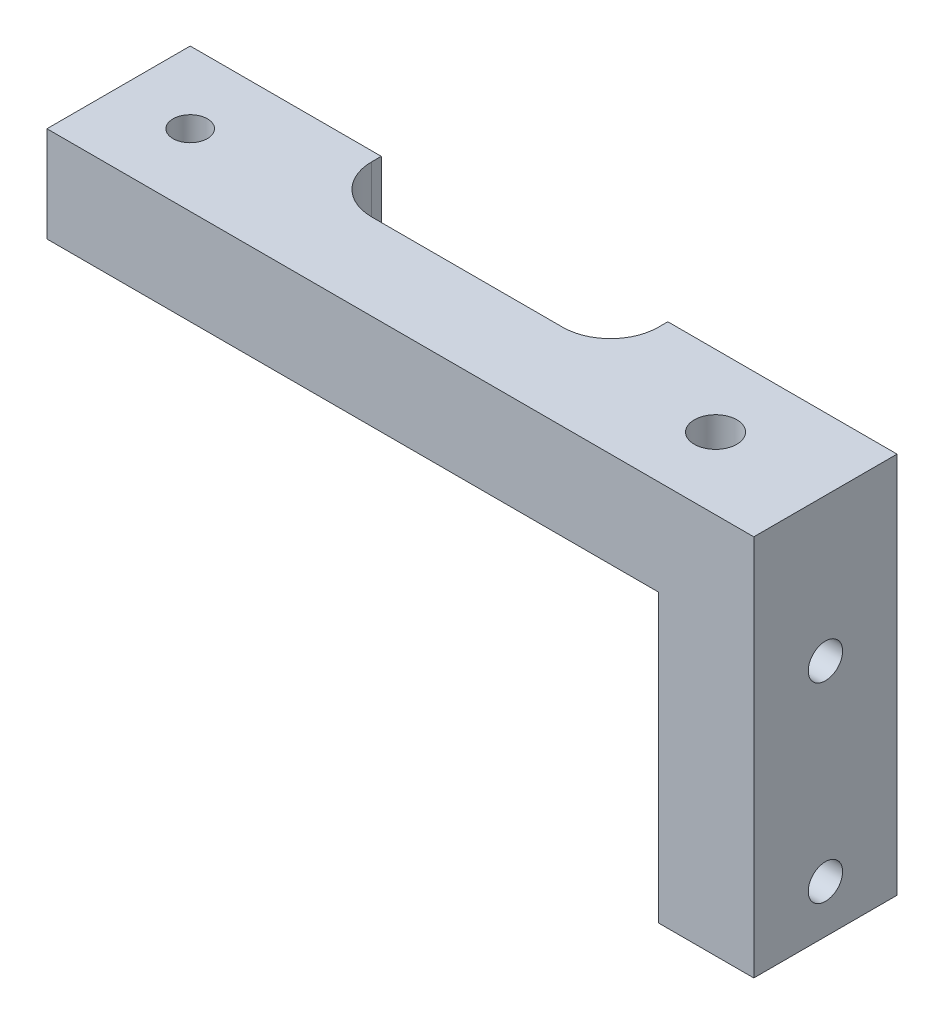
ISO-10303-21;
HEADER;
FILE_DESCRIPTION(('STEP AP214'),'2;1');
FILE_NAME('part.step','',(''),(''),'','','');
FILE_SCHEMA(('AUTOMOTIVE_DESIGN { 1 0 10303 214 1 1 1 1 }'));
ENDSEC;
DATA;
#1=APPLICATION_CONTEXT('core data for automotive mechanical design processes');
#2=APPLICATION_PROTOCOL_DEFINITION('international standard','automotive_design',2000,#1);
#3=PRODUCT_CONTEXT('',#1,'mechanical');
#4=PRODUCT('Part','Part','',(#3));
#5=PRODUCT_RELATED_PRODUCT_CATEGORY('part','',(#4));
#6=PRODUCT_DEFINITION_FORMATION('','',#4);
#7=PRODUCT_DEFINITION_CONTEXT('part definition',#1,'design');
#8=PRODUCT_DEFINITION('design','',#6,#7);
#9=PRODUCT_DEFINITION_SHAPE('','',#8);
#10=(LENGTH_UNIT() NAMED_UNIT(*) SI_UNIT(.MILLI.,.METRE.));
#11=(NAMED_UNIT(*) PLANE_ANGLE_UNIT() SI_UNIT($,.RADIAN.));
#12=(NAMED_UNIT(*) SI_UNIT($,.STERADIAN.) SOLID_ANGLE_UNIT());
#13=UNCERTAINTY_MEASURE_WITH_UNIT(LENGTH_MEASURE(1.E-05),#10,'distance_accuracy_value','');
#14=(GEOMETRIC_REPRESENTATION_CONTEXT(3) GLOBAL_UNCERTAINTY_ASSIGNED_CONTEXT((#13)) GLOBAL_UNIT_ASSIGNED_CONTEXT((#10,
#11,#12)) REPRESENTATION_CONTEXT('',''));
#15=CARTESIAN_POINT('',(0.,0.,0.));
#16=DIRECTION('',(0.,0.,1.));
#17=DIRECTION('',(1.,0.,0.));
#18=AXIS2_PLACEMENT_3D('',#15,#16,#17);
#19=CARTESIAN_POINT('',(-9.525,15.875,4.7625));
#20=DIRECTION('',(1.,0.,0.));
#21=DIRECTION('',(0.,0.,-1.));
#22=AXIS2_PLACEMENT_3D('',#19,#20,#21);
#23=CYLINDRICAL_SURFACE('',#22,1.143);
#24=CARTESIAN_POINT('',(-3.93083249249566,15.875,5.9055));
#25=CARTESIAN_POINT('',(-3.93084373483191,15.8963752694857,5.90550361654662));
#26=CARTESIAN_POINT('',(-3.93000765827515,15.9177367351948,5.90490013973631));
#27=CARTESIAN_POINT('',(-3.92674173888424,15.9602348145911,5.90251509199281));
#28=CARTESIAN_POINT('',(-3.92431468681082,15.9813717562662,5.9007355839141));
#29=CARTESIAN_POINT('',(-3.91488335347916,16.0436678967602,5.8937504752836));
#30=CARTESIAN_POINT('',(-3.90572298923987,16.0843273368617,5.88689595054274));
#31=CARTESIAN_POINT('',(-3.87889253969778,16.1779805227911,5.86600978940312));
#32=CARTESIAN_POINT('',(-3.85933306765925,16.2300234082919,5.85026723862606));
#33=CARTESIAN_POINT('',(-3.81557766279353,16.3300056623705,5.81240653443598));
#34=CARTESIAN_POINT('',(-3.79134707454787,16.3779102188144,5.79024006047459));
#35=CARTESIAN_POINT('',(-3.73138238587999,16.4868186373703,5.73064812841506));
#36=CARTESIAN_POINT('',(-3.69476579001816,16.5459168073645,5.6906228205651));
#37=CARTESIAN_POINT('',(-3.62240824039767,16.655913844966,5.60015854248359));
#38=CARTESIAN_POINT('',(-3.58666570587411,16.7068286124868,5.54974021150636));
#39=CARTESIAN_POINT('',(-3.52618200554403,16.7901230919422,5.44976619188771));
#40=CARTESIAN_POINT('',(-3.50067309992683,16.8241716281817,5.4020711847984));
#41=CARTESIAN_POINT('',(-3.45411134225465,16.8852478360566,5.30041401364303));
#42=CARTESIAN_POINT('',(-3.43305234501261,16.9122852017906,5.24646065389162));
#43=CARTESIAN_POINT('',(-3.40008133565883,16.9541899056459,5.14250124517074));
#44=CARTESIAN_POINT('',(-3.38723427299693,16.9703279197327,5.09330730809732));
#45=CARTESIAN_POINT('',(-3.36677941720066,16.9959035113964,4.99215165576483));
#46=CARTESIAN_POINT('',(-3.35916858053729,17.0053449814033,4.94019156727271));
#47=CARTESIAN_POINT('',(-3.34980307125555,17.0169517173311,4.83473590224313));
#48=CARTESIAN_POINT('',(-3.34806980195119,17.0190903901228,4.78123542771331));
#49=CARTESIAN_POINT('',(-3.35067873840373,17.0158634258158,4.67461213884869));
#50=CARTESIAN_POINT('',(-3.35502108738605,17.010497611808,4.62148933344665));
#51=CARTESIAN_POINT('',(-3.36897334404467,16.9931547553388,4.5202929747828));
#52=CARTESIAN_POINT('',(-3.37826519932184,16.9815766155992,4.47210487686006));
#53=CARTESIAN_POINT('',(-3.40123138246182,16.952709457054,4.37858780890445));
#54=CARTESIAN_POINT('',(-3.41490685830584,16.9354189422569,4.33325959154187));
#55=CARTESIAN_POINT('',(-3.4472703546422,16.8939904195196,4.24207039086234));
#56=CARTESIAN_POINT('',(-3.46630842747067,16.8693619539225,4.19655889888065));
#57=CARTESIAN_POINT('',(-3.50751346480518,16.815018144475,4.11025817617037));
#58=CARTESIAN_POINT('',(-3.52968200853343,16.7853002315415,4.06947134790405));
#59=CARTESIAN_POINT('',(-3.58083762114513,16.7148581909825,3.9848658834835));
#60=CARTESIAN_POINT('',(-3.61028656982664,16.673128970467,3.94216530995956));
#61=CARTESIAN_POINT('',(-3.67017938461612,16.5839376249998,3.86395531897599));
#62=CARTESIAN_POINT('',(-3.70062452927473,16.5364679036861,3.82845560030117));
#63=CARTESIAN_POINT('',(-3.75800503497028,16.4395870474834,3.7671396643609));
#64=CARTESIAN_POINT('',(-3.78503587312763,16.3905556229428,3.74081350093586));
#65=CARTESIAN_POINT('',(-3.83523368846054,16.2875147915302,3.69505238448322));
#66=CARTESIAN_POINT('',(-3.85840817123726,16.233515379779,3.67560396029048));
#67=CARTESIAN_POINT('',(-3.89097267874152,16.1381070721835,3.6494616442056));
#68=CARTESIAN_POINT('',(-3.9024088043216,16.0979849371407,3.64068282496282));
#69=CARTESIAN_POINT('',(-3.91990568123077,16.015958464681,3.62747395098613));
#70=CARTESIAN_POINT('',(-3.92598675905055,15.9740615047376,3.62302744491596));
#71=CARTESIAN_POINT('',(-3.93019229360773,15.9129518046768,3.61996876139128));
#72=CARTESIAN_POINT('',(-3.93085545934835,15.8939756557408,3.61949121321014));
#73=CARTESIAN_POINT('',(-3.93083249249118,15.8749999999997,3.61949999999998));
#74=B_SPLINE_CURVE_WITH_KNOTS('',3,(#24,#25,#26,#27,#28,#29,#30,#31,#32,#33,#34,#35,#36,#37,#38,
#39,#40,#41,#42,#43,#44,#45,#46,#47,#48,#49,#50,#51,#52,#53,#54,#55,#56,#57,#58,#59,#60,#61,#62,
#63,#64,#65,#66,#67,#68,#69,#70,#71,#72,#73),.UNSPECIFIED.,.F.,.F.,(4,2,2,2,2,2,2,2,2,2,2,2,2,2,
2,2,2,2,2,2,2,2,2,2,4),(0.,0.0640767086173542,0.128041318740954,0.254153859464511,
0.426558136816626,0.600294475183116,0.839796503023003,1.07882741408584,1.26984858000115,
1.46060420217215,1.61996045137766,1.77922399716499,1.93906688606315,2.0989135431291,
2.24954654389144,2.40021902465034,2.56503681214821,2.72993804395363,2.92894968206862,
3.12822761337995,3.31329780117682,3.49800346478365,3.62544615286615,3.7524029873361,
3.80932217702741),.UNSPECIFIED.);
#75=CARTESIAN_POINT('',(-3.81,16.3393117562172,5.80694415505976));
#76=VERTEX_POINT('',#75);
#77=CARTESIAN_POINT('',(-3.81,16.3393117562172,3.71805584494024));
#78=VERTEX_POINT('',#77);
#79=EDGE_CURVE('E224',#76,#78,#74,.T.);
#80=ORIENTED_EDGE('',*,*,#79,.T.);
#81=CARTESIAN_POINT('',(-3.81,15.875,4.7625));
#82=DIRECTION('',(-1.,0.,0.));
#83=DIRECTION('',(0.,0.,1.));
#84=AXIS2_PLACEMENT_3D('',#81,#82,#83);
#85=CIRCLE('',#84,1.143);
#86=EDGE_CURVE('E156',#78,#76,#85,.T.);
#87=ORIENTED_EDGE('',*,*,#86,.T.);
#88=EDGE_LOOP('',(#80,#87));
#89=FACE_BOUND('',#88,.T.);
#90=CARTESIAN_POINT('',(2.54,15.875,4.7625));
#91=DIRECTION('',(1.,0.,0.));
#92=DIRECTION('',(0.,0.,-1.));
#93=AXIS2_PLACEMENT_3D('',#90,#91,#92);
#94=CIRCLE('',#93,1.143);
#95=CARTESIAN_POINT('',(2.54,15.875,3.6195));
#96=VERTEX_POINT('',#95);
#97=EDGE_CURVE('E291',#96,#96,#94,.T.);
#98=ORIENTED_EDGE('',*,*,#97,.T.);
#99=EDGE_LOOP('',(#98));
#100=FACE_BOUND('',#99,.T.);
#101=ADVANCED_FACE('F42',(#89,#100),#23,.F.);
#102=CARTESIAN_POINT('',(0.,0.,0.));
#103=DIRECTION('',(0.,0.,1.));
#104=DIRECTION('',(1.,0.,0.));
#105=AXIS2_PLACEMENT_3D('',#102,#103,#104);
#106=PLANE('',#105);
#107=DIRECTION('',(0.,-1.,0.));
#108=VECTOR('',#107,1.);
#109=CARTESIAN_POINT('',(-3.81,0.,0.));
#110=LINE('',#109,#108);
#111=CARTESIAN_POINT('',(-3.81,19.05,0.));
#112=VERTEX_POINT('',#111);
#113=CARTESIAN_POINT('',(-3.81,0.,0.));
#114=VERTEX_POINT('',#113);
#115=EDGE_CURVE('E145',#112,#114,#110,.T.);
#116=ORIENTED_EDGE('',*,*,#115,.F.);
#117=DIRECTION('',(1.,0.,0.));
#118=VECTOR('',#117,1.);
#119=CARTESIAN_POINT('',(-44.45,19.05,0.));
#120=LINE('',#119,#118);
#121=CARTESIAN_POINT('',(-12.7,19.05,0.));
#122=VERTEX_POINT('',#121);
#123=EDGE_CURVE('E340',#122,#112,#120,.T.);
#124=ORIENTED_EDGE('',*,*,#123,.F.);
#125=DIRECTION('',(0.,1.,0.));
#126=VECTOR('',#125,1.);
#127=CARTESIAN_POINT('',(-12.7,0.,0.));
#128=LINE('',#127,#126);
#129=CARTESIAN_POINT('',(-12.7,25.4,0.));
#130=VERTEX_POINT('',#129);
#131=EDGE_CURVE('E330',#122,#130,#128,.T.);
#132=ORIENTED_EDGE('',*,*,#131,.T.);
#133=DIRECTION('',(-1.,0.,0.));
#134=VECTOR('',#133,1.);
#135=CARTESIAN_POINT('',(0.,25.4,0.));
#136=LINE('',#135,#134);
#137=CARTESIAN_POINT('',(2.54,25.4,0.));
#138=VERTEX_POINT('',#137);
#139=EDGE_CURVE('E181',#138,#130,#136,.T.);
#140=ORIENTED_EDGE('',*,*,#139,.F.);
#141=DIRECTION('',(0.,1.,0.));
#142=VECTOR('',#141,1.);
#143=CARTESIAN_POINT('',(2.54,25.4,0.));
#144=LINE('',#143,#142);
#145=CARTESIAN_POINT('',(2.54,0.,0.));
#146=VERTEX_POINT('',#145);
#147=EDGE_CURVE('E171',#146,#138,#144,.T.);
#148=ORIENTED_EDGE('',*,*,#147,.F.);
#149=DIRECTION('',(1.,0.,0.));
#150=VECTOR('',#149,1.);
#151=CARTESIAN_POINT('',(0.,0.,0.));
#152=LINE('',#151,#150);
#153=EDGE_CURVE('E162',#114,#146,#152,.T.);
#154=ORIENTED_EDGE('',*,*,#153,.F.);
#155=EDGE_LOOP('',(#116,#124,#132,#140,#148,#154));
#156=FACE_BOUND('',#155,.T.);
#157=ADVANCED_FACE('F169',(#156),#106,.F.);
#158=CARTESIAN_POINT('',(0.,25.4,9.525));
#159=DIRECTION('',(0.,-1.,0.));
#160=DIRECTION('',(1.,0.,0.));
#161=AXIS2_PLACEMENT_3D('',#158,#159,#160);
#162=PLANE('',#161);
#163=CARTESIAN_POINT('',(-39.6875,25.4,4.7625));
#164=DIRECTION('',(0.,1.,0.));
#165=DIRECTION('',(-1.,0.,0.));
#166=AXIS2_PLACEMENT_3D('',#163,#164,#165);
#167=CIRCLE('',#166,1.143);
#168=CARTESIAN_POINT('',(-40.8305,25.4,4.7625));
#169=VERTEX_POINT('',#168);
#170=EDGE_CURVE('E230',#169,#169,#167,.T.);
#171=ORIENTED_EDGE('',*,*,#170,.F.);
#172=EDGE_LOOP('',(#171));
#173=FACE_BOUND('',#172,.T.);
#174=CARTESIAN_POINT('',(-4.7625,25.4,4.7625));
#175=DIRECTION('',(0.,1.,0.));
#176=DIRECTION('',(-1.,0.,0.));
#177=AXIS2_PLACEMENT_3D('',#174,#175,#176);
#178=CIRCLE('',#177,1.41354867020506);
#179=CARTESIAN_POINT('',(-6.17604867020505,25.4,4.7625));
#180=VERTEX_POINT('',#179);
#181=EDGE_CURVE('E314',#180,#180,#178,.T.);
#182=ORIENTED_EDGE('',*,*,#181,.F.);
#183=EDGE_LOOP('',(#182));
#184=FACE_BOUND('',#183,.T.);
#185=ORIENTED_EDGE('',*,*,#139,.T.);
#186=DIRECTION('',(0.,0.,-1.));
#187=VECTOR('',#186,1.);
#188=CARTESIAN_POINT('',(-12.7,25.4,3.81000000000001));
#189=LINE('',#188,#187);
#190=CARTESIAN_POINT('',(-12.7,25.4,0.635000000000006));
#191=VERTEX_POINT('',#190);
#192=EDGE_CURVE('E229',#191,#130,#189,.T.);
#193=ORIENTED_EDGE('',*,*,#192,.F.);
#194=CARTESIAN_POINT('',(-15.875,25.4,0.635000000000005));
#195=DIRECTION('',(0.,-1.,0.));
#196=DIRECTION('',(1.,0.,0.));
#197=AXIS2_PLACEMENT_3D('',#194,#195,#196);
#198=CIRCLE('',#197,3.175);
#199=CARTESIAN_POINT('',(-15.875,25.4,3.81000000000001));
#200=VERTEX_POINT('',#199);
#201=EDGE_CURVE('E212',#191,#200,#198,.T.);
#202=ORIENTED_EDGE('',*,*,#201,.T.);
#203=DIRECTION('',(1.,0.,0.));
#204=VECTOR('',#203,1.);
#205=CARTESIAN_POINT('',(-31.75,25.4,3.81000000000001));
#206=LINE('',#205,#204);
#207=CARTESIAN_POINT('',(-28.575,25.4,3.81000000000001));
#208=VERTEX_POINT('',#207);
#209=EDGE_CURVE('E326',#208,#200,#206,.T.);
#210=ORIENTED_EDGE('',*,*,#209,.F.);
#211=CARTESIAN_POINT('',(-28.575,25.4,0.635000000000005));
#212=DIRECTION('',(0.,-1.,0.));
#213=DIRECTION('',(1.,0.,0.));
#214=AXIS2_PLACEMENT_3D('',#211,#212,#213);
#215=CIRCLE('',#214,3.175);
#216=CARTESIAN_POINT('',(-31.75,25.4,0.635000000000006));
#217=VERTEX_POINT('',#216);
#218=EDGE_CURVE('E218',#208,#217,#215,.T.);
#219=ORIENTED_EDGE('',*,*,#218,.T.);
#220=DIRECTION('',(0.,0.,1.));
#221=VECTOR('',#220,1.);
#222=CARTESIAN_POINT('',(-31.75,25.4,3.81000000000001));
#223=LINE('',#222,#221);
#224=CARTESIAN_POINT('',(-31.75,25.4,0.));
#225=VERTEX_POINT('',#224);
#226=EDGE_CURVE('E323',#225,#217,#223,.T.);
#227=ORIENTED_EDGE('',*,*,#226,.F.);
#228=CARTESIAN_POINT('',(-44.45,25.4,0.));
#229=VERTEX_POINT('',#228);
#230=EDGE_CURVE('E347',#225,#229,#136,.T.);
#231=ORIENTED_EDGE('',*,*,#230,.T.);
#232=DIRECTION('',(0.,0.,-1.));
#233=VECTOR('',#232,1.);
#234=CARTESIAN_POINT('',(-44.45,25.4,9.525));
#235=LINE('',#234,#233);
#236=CARTESIAN_POINT('',(-44.45,25.4,9.525));
#237=VERTEX_POINT('',#236);
#238=EDGE_CURVE('E185',#237,#229,#235,.T.);
#239=ORIENTED_EDGE('',*,*,#238,.F.);
#240=DIRECTION('',(-1.,0.,0.));
#241=VECTOR('',#240,1.);
#242=CARTESIAN_POINT('',(0.,25.4,9.525));
#243=LINE('',#242,#241);
#244=CARTESIAN_POINT('',(2.54,25.4,9.525));
#245=VERTEX_POINT('',#244);
#246=EDGE_CURVE('E173',#245,#237,#243,.T.);
#247=ORIENTED_EDGE('',*,*,#246,.F.);
#248=DIRECTION('',(0.,0.,1.));
#249=VECTOR('',#248,1.);
#250=CARTESIAN_POINT('',(2.54,25.4,9.525));
#251=LINE('',#250,#249);
#252=EDGE_CURVE('E310',#138,#245,#251,.T.);
#253=ORIENTED_EDGE('',*,*,#252,.F.);
#254=EDGE_LOOP('',(#185,#193,#202,#210,#219,#227,#231,#239,#247,#253));
#255=FACE_BOUND('',#254,.T.);
#256=ADVANCED_FACE('F285',(#173,#184,#255),#162,.F.);
#257=CARTESIAN_POINT('',(-44.45,0.,9.525));
#258=DIRECTION('',(1.,0.,0.));
#259=DIRECTION('',(0.,0.,-1.));
#260=AXIS2_PLACEMENT_3D('',#257,#258,#259);
#261=PLANE('',#260);
#262=DIRECTION('',(0.,-1.,0.));
#263=VECTOR('',#262,1.);
#264=CARTESIAN_POINT('',(-44.45,0.,0.));
#265=LINE('',#264,#263);
#266=CARTESIAN_POINT('',(-44.45,19.05,0.));
#267=VERTEX_POINT('',#266);
#268=EDGE_CURVE('E174',#229,#267,#265,.T.);
#269=ORIENTED_EDGE('',*,*,#268,.T.);
#270=DIRECTION('',(0.,0.,-1.));
#271=VECTOR('',#270,1.);
#272=CARTESIAN_POINT('',(-44.45,19.05,0.));
#273=LINE('',#272,#271);
#274=CARTESIAN_POINT('',(-44.45,19.05,9.525));
#275=VERTEX_POINT('',#274);
#276=EDGE_CURVE('E334',#275,#267,#273,.T.);
#277=ORIENTED_EDGE('',*,*,#276,.F.);
#278=DIRECTION('',(0.,-1.,0.));
#279=VECTOR('',#278,1.);
#280=CARTESIAN_POINT('',(-44.45,0.,9.525));
#281=LINE('',#280,#279);
#282=EDGE_CURVE('E178',#237,#275,#281,.T.);
#283=ORIENTED_EDGE('',*,*,#282,.F.);
#284=ORIENTED_EDGE('',*,*,#238,.T.);
#285=EDGE_LOOP('',(#269,#277,#283,#284));
#286=FACE_BOUND('',#285,.T.);
#287=ADVANCED_FACE('F366',(#286),#261,.F.);
#288=CARTESIAN_POINT('',(0.,0.,9.525));
#289=DIRECTION('',(0.,1.,0.));
#290=DIRECTION('',(-1.,0.,0.));
#291=AXIS2_PLACEMENT_3D('',#288,#289,#290);
#292=PLANE('',#291);
#293=DIRECTION('',(1.,0.,0.));
#294=VECTOR('',#293,1.);
#295=CARTESIAN_POINT('',(0.,0.,9.525));
#296=LINE('',#295,#294);
#297=CARTESIAN_POINT('',(-3.81,0.,9.525));
#298=VERTEX_POINT('',#297);
#299=CARTESIAN_POINT('',(2.54,0.,9.525));
#300=VERTEX_POINT('',#299);
#301=EDGE_CURVE('E164',#298,#300,#296,.T.);
#302=ORIENTED_EDGE('',*,*,#301,.F.);
#303=DIRECTION('',(0.,0.,1.));
#304=VECTOR('',#303,1.);
#305=CARTESIAN_POINT('',(-3.81,0.,0.));
#306=LINE('',#305,#304);
#307=EDGE_CURVE('E148',#114,#298,#306,.T.);
#308=ORIENTED_EDGE('',*,*,#307,.F.);
#309=ORIENTED_EDGE('',*,*,#153,.T.);
#310=DIRECTION('',(0.,0.,-1.));
#311=VECTOR('',#310,1.);
#312=CARTESIAN_POINT('',(2.54,0.,9.525));
#313=LINE('',#312,#311);
#314=EDGE_CURVE('E300',#300,#146,#313,.T.);
#315=ORIENTED_EDGE('',*,*,#314,.F.);
#316=EDGE_LOOP('',(#302,#308,#309,#315));
#317=FACE_BOUND('',#316,.T.);
#318=ADVANCED_FACE('F160',(#317),#292,.F.);
#319=CARTESIAN_POINT('',(0.,0.,9.525));
#320=DIRECTION('',(0.,0.,1.));
#321=DIRECTION('',(1.,0.,0.));
#322=AXIS2_PLACEMENT_3D('',#319,#320,#321);
#323=PLANE('',#322);
#324=DIRECTION('',(-1.,0.,0.));
#325=VECTOR('',#324,1.);
#326=CARTESIAN_POINT('',(-44.45,19.05,9.525));
#327=LINE('',#326,#325);
#328=CARTESIAN_POINT('',(-3.81,19.05,9.525));
#329=VERTEX_POINT('',#328);
#330=EDGE_CURVE('E345',#329,#275,#327,.T.);
#331=ORIENTED_EDGE('',*,*,#330,.F.);
#332=DIRECTION('',(0.,1.,0.));
#333=VECTOR('',#332,1.);
#334=CARTESIAN_POINT('',(-3.81,0.,9.525));
#335=LINE('',#334,#333);
#336=EDGE_CURVE('E166',#298,#329,#335,.T.);
#337=ORIENTED_EDGE('',*,*,#336,.F.);
#338=ORIENTED_EDGE('',*,*,#301,.T.);
#339=DIRECTION('',(0.,-1.,0.));
#340=VECTOR('',#339,1.);
#341=CARTESIAN_POINT('',(2.54,25.4,9.525));
#342=LINE('',#341,#340);
#343=EDGE_CURVE('E294',#245,#300,#342,.T.);
#344=ORIENTED_EDGE('',*,*,#343,.F.);
#345=ORIENTED_EDGE('',*,*,#246,.T.);
#346=ORIENTED_EDGE('',*,*,#282,.T.);
#347=EDGE_LOOP('',(#331,#337,#338,#344,#345,#346));
#348=FACE_BOUND('',#347,.T.);
#349=ADVANCED_FACE('F275',(#348),#323,.T.);
#350=ORIENTED_EDGE('',*,*,#230,.F.);
#351=DIRECTION('',(0.,1.,0.));
#352=VECTOR('',#351,1.);
#353=CARTESIAN_POINT('',(-31.75,0.,0.));
#354=LINE('',#353,#352);
#355=CARTESIAN_POINT('',(-31.75,19.05,0.));
#356=VERTEX_POINT('',#355);
#357=EDGE_CURVE('E331',#356,#225,#354,.T.);
#358=ORIENTED_EDGE('',*,*,#357,.F.);
#359=EDGE_CURVE('E341',#267,#356,#120,.T.);
#360=ORIENTED_EDGE('',*,*,#359,.F.);
#361=ORIENTED_EDGE('',*,*,#268,.F.);
#362=EDGE_LOOP('',(#350,#358,#360,#361));
#363=FACE_BOUND('',#362,.T.);
#364=ADVANCED_FACE('F270',(#363),#106,.F.);
#365=CARTESIAN_POINT('',(-9.525,3.175,4.7625));
#366=DIRECTION('',(1.,0.,0.));
#367=DIRECTION('',(0.,0.,-1.));
#368=AXIS2_PLACEMENT_3D('',#365,#366,#367);
#369=CYLINDRICAL_SURFACE('',#368,1.143);
#370=CARTESIAN_POINT('',(-3.81,3.175,4.7625));
#371=DIRECTION('',(-1.,0.,0.));
#372=DIRECTION('',(0.,0.,1.));
#373=AXIS2_PLACEMENT_3D('',#370,#371,#372);
#374=CIRCLE('',#373,1.143);
#375=CARTESIAN_POINT('',(-3.81,3.175,5.9055));
#376=VERTEX_POINT('',#375);
#377=EDGE_CURVE('E385',#376,#376,#374,.T.);
#378=ORIENTED_EDGE('',*,*,#377,.T.);
#379=EDGE_LOOP('',(#378));
#380=FACE_BOUND('',#379,.T.);
#381=CARTESIAN_POINT('',(2.54,3.175,4.7625));
#382=DIRECTION('',(1.,0.,0.));
#383=DIRECTION('',(0.,0.,-1.));
#384=AXIS2_PLACEMENT_3D('',#381,#382,#383);
#385=CIRCLE('',#384,1.143);
#386=CARTESIAN_POINT('',(2.54,3.175,3.6195));
#387=VERTEX_POINT('',#386);
#388=EDGE_CURVE('E295',#387,#387,#385,.T.);
#389=ORIENTED_EDGE('',*,*,#388,.T.);
#390=EDGE_LOOP('',(#389));
#391=FACE_BOUND('',#390,.T.);
#392=ADVANCED_FACE('F267',(#380,#391),#369,.F.);
#393=CARTESIAN_POINT('',(0.,19.05,0.));
#394=DIRECTION('',(0.,1.,0.));
#395=DIRECTION('',(0.,0.,1.));
#396=AXIS2_PLACEMENT_3D('',#393,#394,#395);
#397=PLANE('',#396);
#398=CARTESIAN_POINT('',(-39.6875,19.05,4.7625));
#399=DIRECTION('',(0.,1.,0.));
#400=DIRECTION('',(0.,0.,1.));
#401=AXIS2_PLACEMENT_3D('',#398,#399,#400);
#402=CIRCLE('',#401,1.143);
#403=CARTESIAN_POINT('',(-39.6875,19.05,5.9055));
#404=VERTEX_POINT('',#403);
#405=EDGE_CURVE('E225',#404,#404,#402,.T.);
#406=ORIENTED_EDGE('',*,*,#405,.T.);
#407=EDGE_LOOP('',(#406));
#408=FACE_BOUND('',#407,.T.);
#409=DIRECTION('',(0.,0.,1.));
#410=VECTOR('',#409,1.);
#411=CARTESIAN_POINT('',(-31.75,19.05,0.));
#412=LINE('',#411,#410);
#413=CARTESIAN_POINT('',(-31.75,19.05,0.635000000000005));
#414=VERTEX_POINT('',#413);
#415=EDGE_CURVE('E189',#356,#414,#412,.T.);
#416=ORIENTED_EDGE('',*,*,#415,.T.);
#417=CARTESIAN_POINT('',(-28.575,19.05,0.635000000000005));
#418=DIRECTION('',(0.,1.,0.));
#419=DIRECTION('',(0.,0.,1.));
#420=AXIS2_PLACEMENT_3D('',#417,#418,#419);
#421=CIRCLE('',#420,3.175);
#422=CARTESIAN_POINT('',(-28.575,19.05,3.81000000000001));
#423=VERTEX_POINT('',#422);
#424=EDGE_CURVE('E221',#414,#423,#421,.T.);
#425=ORIENTED_EDGE('',*,*,#424,.T.);
#426=DIRECTION('',(1.,0.,0.));
#427=VECTOR('',#426,1.);
#428=CARTESIAN_POINT('',(0.,19.05,3.81000000000001));
#429=LINE('',#428,#427);
#430=CARTESIAN_POINT('',(-15.875,19.05,3.81000000000001));
#431=VERTEX_POINT('',#430);
#432=EDGE_CURVE('E192',#423,#431,#429,.T.);
#433=ORIENTED_EDGE('',*,*,#432,.T.);
#434=CARTESIAN_POINT('',(-15.875,19.05,0.635000000000005));
#435=DIRECTION('',(0.,1.,0.));
#436=DIRECTION('',(0.,0.,1.));
#437=AXIS2_PLACEMENT_3D('',#434,#435,#436);
#438=CIRCLE('',#437,3.175);
#439=CARTESIAN_POINT('',(-12.7,19.05,0.635000000000005));
#440=VERTEX_POINT('',#439);
#441=EDGE_CURVE('E215',#431,#440,#438,.T.);
#442=ORIENTED_EDGE('',*,*,#441,.T.);
#443=DIRECTION('',(0.,0.,-1.));
#444=VECTOR('',#443,1.);
#445=CARTESIAN_POINT('',(-12.7,19.05,0.));
#446=LINE('',#445,#444);
#447=EDGE_CURVE('E196',#440,#122,#446,.T.);
#448=ORIENTED_EDGE('',*,*,#447,.T.);
#449=ORIENTED_EDGE('',*,*,#123,.T.);
#450=DIRECTION('',(0.,0.,-1.));
#451=VECTOR('',#450,1.);
#452=CARTESIAN_POINT('',(-3.81,19.05,0.));
#453=LINE('',#452,#451);
#454=CARTESIAN_POINT('',(-3.81,19.05,3.71805584494024));
#455=VERTEX_POINT('',#454);
#456=EDGE_CURVE('E151',#455,#112,#453,.T.);
#457=ORIENTED_EDGE('',*,*,#456,.F.);
#458=CARTESIAN_POINT('',(-4.7625,19.05,4.7625));
#459=DIRECTION('',(0.,1.,0.));
#460=DIRECTION('',(0.,0.,1.));
#461=AXIS2_PLACEMENT_3D('',#458,#459,#460);
#462=CIRCLE('',#461,1.41354867020506);
#463=CARTESIAN_POINT('',(-3.81,19.05,5.80694415505976));
#464=VERTEX_POINT('',#463);
#465=EDGE_CURVE('E51',#464,#455,#462,.F.);
#466=ORIENTED_EDGE('',*,*,#465,.F.);
#467=EDGE_CURVE('E58',#329,#464,#453,.T.);
#468=ORIENTED_EDGE('',*,*,#467,.F.);
#469=ORIENTED_EDGE('',*,*,#330,.T.);
#470=ORIENTED_EDGE('',*,*,#276,.T.);
#471=ORIENTED_EDGE('',*,*,#359,.T.);
#472=EDGE_LOOP('',(#416,#425,#433,#442,#448,#449,#457,#466,#468,#469,#470,#471));
#473=FACE_BOUND('',#472,.T.);
#474=ADVANCED_FACE('F264',(#408,#473),#397,.F.);
#475=CARTESIAN_POINT('',(-12.7,0.,3.81000000000001));
#476=DIRECTION('',(1.,0.,0.));
#477=DIRECTION('',(0.,1.,0.));
#478=AXIS2_PLACEMENT_3D('',#475,#476,#477);
#479=PLANE('',#478);
#480=ORIENTED_EDGE('',*,*,#447,.F.);
#481=DIRECTION('',(0.,1.,0.));
#482=VECTOR('',#481,1.);
#483=CARTESIAN_POINT('',(-12.7,25.4,0.635000000000005));
#484=LINE('',#483,#482);
#485=EDGE_CURVE('E199',#440,#191,#484,.T.);
#486=ORIENTED_EDGE('',*,*,#485,.T.);
#487=ORIENTED_EDGE('',*,*,#192,.T.);
#488=ORIENTED_EDGE('',*,*,#131,.F.);
#489=EDGE_LOOP('',(#480,#486,#487,#488));
#490=FACE_BOUND('',#489,.T.);
#491=ADVANCED_FACE('F257',(#490),#479,.F.);
#492=CARTESIAN_POINT('',(-31.75,0.,3.81000000000001));
#493=DIRECTION('',(0.,0.,1.));
#494=DIRECTION('',(1.,0.,0.));
#495=AXIS2_PLACEMENT_3D('',#492,#493,#494);
#496=PLANE('',#495);
#497=ORIENTED_EDGE('',*,*,#209,.T.);
#498=DIRECTION('',(0.,1.,0.));
#499=VECTOR('',#498,1.);
#500=CARTESIAN_POINT('',(-15.875,19.05,3.81000000000001));
#501=LINE('',#500,#499);
#502=EDGE_CURVE('E207',#200,#431,#501,.F.);
#503=ORIENTED_EDGE('',*,*,#502,.T.);
#504=ORIENTED_EDGE('',*,*,#432,.F.);
#505=DIRECTION('',(0.,1.,0.));
#506=VECTOR('',#505,1.);
#507=CARTESIAN_POINT('',(-28.575,25.4,3.81000000000001));
#508=LINE('',#507,#506);
#509=EDGE_CURVE('E203',#423,#208,#508,.T.);
#510=ORIENTED_EDGE('',*,*,#509,.T.);
#511=EDGE_LOOP('',(#497,#503,#504,#510));
#512=FACE_BOUND('',#511,.T.);
#513=ADVANCED_FACE('F253',(#512),#496,.F.);
#514=CARTESIAN_POINT('',(-31.75,0.,3.81000000000001));
#515=DIRECTION('',(-1.,0.,0.));
#516=DIRECTION('',(0.,-1.,0.));
#517=AXIS2_PLACEMENT_3D('',#514,#515,#516);
#518=PLANE('',#517);
#519=ORIENTED_EDGE('',*,*,#226,.T.);
#520=DIRECTION('',(0.,1.,0.));
#521=VECTOR('',#520,1.);
#522=CARTESIAN_POINT('',(-31.75,19.05,0.635000000000005));
#523=LINE('',#522,#521);
#524=EDGE_CURVE('E66',#217,#414,#523,.F.);
#525=ORIENTED_EDGE('',*,*,#524,.T.);
#526=ORIENTED_EDGE('',*,*,#415,.F.);
#527=ORIENTED_EDGE('',*,*,#357,.T.);
#528=EDGE_LOOP('',(#519,#525,#526,#527));
#529=FACE_BOUND('',#528,.T.);
#530=ADVANCED_FACE('F256',(#529),#518,.F.);
#531=CARTESIAN_POINT('',(-15.875,0.,0.635000000000005));
#532=DIRECTION('',(0.,-1.,0.));
#533=DIRECTION('',(1.,0.,0.));
#534=AXIS2_PLACEMENT_3D('',#531,#532,#533);
#535=CYLINDRICAL_SURFACE('',#534,3.175);
#536=ORIENTED_EDGE('',*,*,#441,.F.);
#537=ORIENTED_EDGE('',*,*,#502,.F.);
#538=ORIENTED_EDGE('',*,*,#201,.F.);
#539=ORIENTED_EDGE('',*,*,#485,.F.);
#540=EDGE_LOOP('',(#536,#537,#538,#539));
#541=FACE_BOUND('',#540,.T.);
#542=ADVANCED_FACE('F261',(#541),#535,.F.);
#543=CARTESIAN_POINT('',(-28.575,0.,0.635000000000005));
#544=DIRECTION('',(0.,-1.,0.));
#545=DIRECTION('',(1.,0.,0.));
#546=AXIS2_PLACEMENT_3D('',#543,#544,#545);
#547=CYLINDRICAL_SURFACE('',#546,3.175);
#548=ORIENTED_EDGE('',*,*,#424,.F.);
#549=ORIENTED_EDGE('',*,*,#524,.F.);
#550=ORIENTED_EDGE('',*,*,#218,.F.);
#551=ORIENTED_EDGE('',*,*,#509,.F.);
#552=EDGE_LOOP('',(#548,#549,#550,#551));
#553=FACE_BOUND('',#552,.T.);
#554=ADVANCED_FACE('F44',(#553),#547,.F.);
#555=CARTESIAN_POINT('',(-39.6875,15.875,4.7625));
#556=DIRECTION('',(0.,1.,0.));
#557=DIRECTION('',(-1.,0.,0.));
#558=AXIS2_PLACEMENT_3D('',#555,#556,#557);
#559=CYLINDRICAL_SURFACE('',#558,1.143);
#560=ORIENTED_EDGE('',*,*,#170,.T.);
#561=EDGE_LOOP('',(#560));
#562=FACE_BOUND('',#561,.T.);
#563=ORIENTED_EDGE('',*,*,#405,.F.);
#564=EDGE_LOOP('',(#563));
#565=FACE_BOUND('',#564,.T.);
#566=ADVANCED_FACE('F250',(#562,#565),#559,.F.);
#567=CARTESIAN_POINT('',(-4.76249999999999,15.875,4.7625));
#568=DIRECTION('',(0.,1.,0.));
#569=DIRECTION('',(-1.,0.,0.));
#570=AXIS2_PLACEMENT_3D('',#567,#568,#569);
#571=CYLINDRICAL_SURFACE('',#570,1.41354867020506);
#572=ORIENTED_EDGE('',*,*,#181,.T.);
#573=EDGE_LOOP('',(#572));
#574=FACE_BOUND('',#573,.T.);
#575=ORIENTED_EDGE('',*,*,#465,.T.);
#576=DIRECTION('',(0.,1.,0.));
#577=VECTOR('',#576,1.);
#578=CARTESIAN_POINT('',(-3.81,15.875,3.71805584494024));
#579=LINE('',#578,#577);
#580=EDGE_CURVE('E11',#455,#78,#579,.F.);
#581=ORIENTED_EDGE('',*,*,#580,.T.);
#582=ORIENTED_EDGE('',*,*,#79,.F.);
#583=DIRECTION('',(0.,1.,0.));
#584=VECTOR('',#583,1.);
#585=CARTESIAN_POINT('',(-3.81,15.875,5.80694415505976));
#586=LINE('',#585,#584);
#587=EDGE_CURVE('E240',#76,#464,#586,.T.);
#588=ORIENTED_EDGE('',*,*,#587,.T.);
#589=EDGE_LOOP('',(#575,#581,#582,#588));
#590=FACE_BOUND('',#589,.T.);
#591=ADVANCED_FACE('F244',(#574,#590),#571,.F.);
#592=CARTESIAN_POINT('',(2.54,0.,0.));
#593=DIRECTION('',(1.,0.,0.));
#594=DIRECTION('',(0.,0.,-1.));
#595=AXIS2_PLACEMENT_3D('',#592,#593,#594);
#596=PLANE('',#595);
#597=ORIENTED_EDGE('',*,*,#97,.F.);
#598=EDGE_LOOP('',(#597));
#599=FACE_BOUND('',#598,.T.);
#600=ORIENTED_EDGE('',*,*,#343,.T.);
#601=ORIENTED_EDGE('',*,*,#314,.T.);
#602=ORIENTED_EDGE('',*,*,#147,.T.);
#603=ORIENTED_EDGE('',*,*,#252,.T.);
#604=EDGE_LOOP('',(#600,#601,#602,#603));
#605=FACE_BOUND('',#604,.T.);
#606=ORIENTED_EDGE('',*,*,#388,.F.);
#607=EDGE_LOOP('',(#606));
#608=FACE_BOUND('',#607,.T.);
#609=ADVANCED_FACE('F249',(#599,#605,#608),#596,.T.);
#610=CARTESIAN_POINT('',(-3.81,0.,0.));
#611=DIRECTION('',(1.,0.,0.));
#612=DIRECTION('',(0.,0.,-1.));
#613=AXIS2_PLACEMENT_3D('',#610,#611,#612);
#614=PLANE('',#613);
#615=ORIENTED_EDGE('',*,*,#377,.F.);
#616=EDGE_LOOP('',(#615));
#617=FACE_BOUND('',#616,.T.);
#618=ORIENTED_EDGE('',*,*,#456,.T.);
#619=ORIENTED_EDGE('',*,*,#115,.T.);
#620=ORIENTED_EDGE('',*,*,#307,.T.);
#621=ORIENTED_EDGE('',*,*,#336,.T.);
#622=ORIENTED_EDGE('',*,*,#467,.T.);
#623=ORIENTED_EDGE('',*,*,#587,.F.);
#624=ORIENTED_EDGE('',*,*,#86,.F.);
#625=ORIENTED_EDGE('',*,*,#580,.F.);
#626=EDGE_LOOP('',(#618,#619,#620,#621,#622,#623,#624,#625));
#627=FACE_BOUND('',#626,.T.);
#628=ADVANCED_FACE('F147',(#617,#627),#614,.F.);
#629=CLOSED_SHELL('',(#101,#157,#256,#287,#318,#349,#364,#392,#474,#491,#513,#530,#542,#554,
#566,#591,#609,#628));
#630=MANIFOLD_SOLID_BREP('B2',#629);
#631=ADVANCED_BREP_SHAPE_REPRESENTATION('',(#18,#630),#14);
#632=SHAPE_DEFINITION_REPRESENTATION(#9,#631);
ENDSEC;
END-ISO-10303-21;
